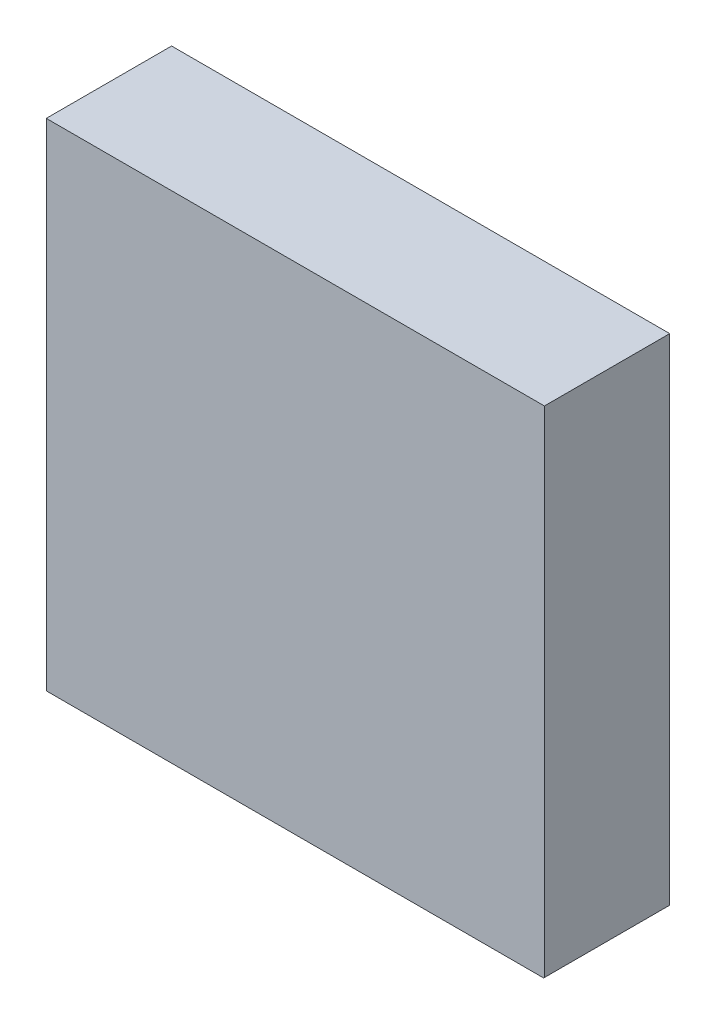
ISO-10303-21;
HEADER;
FILE_DESCRIPTION(('STEP AP214'),'2;1');
FILE_NAME('part.step','',(''),(''),'','','');
FILE_SCHEMA(('AUTOMOTIVE_DESIGN { 1 0 10303 214 1 1 1 1 }'));
ENDSEC;
DATA;
#1=APPLICATION_CONTEXT('core data for automotive mechanical design processes');
#2=APPLICATION_PROTOCOL_DEFINITION('international standard','automotive_design',2000,#1);
#3=PRODUCT_CONTEXT('',#1,'mechanical');
#4=PRODUCT('Part','Part','',(#3));
#5=PRODUCT_RELATED_PRODUCT_CATEGORY('part','',(#4));
#6=PRODUCT_DEFINITION_FORMATION('','',#4);
#7=PRODUCT_DEFINITION_CONTEXT('part definition',#1,'design');
#8=PRODUCT_DEFINITION('design','',#6,#7);
#9=PRODUCT_DEFINITION_SHAPE('','',#8);
#10=(LENGTH_UNIT() NAMED_UNIT(*) SI_UNIT(.MILLI.,.METRE.));
#11=(NAMED_UNIT(*) PLANE_ANGLE_UNIT() SI_UNIT($,.RADIAN.));
#12=(NAMED_UNIT(*) SI_UNIT($,.STERADIAN.) SOLID_ANGLE_UNIT());
#13=UNCERTAINTY_MEASURE_WITH_UNIT(LENGTH_MEASURE(1.E-05),#10,'distance_accuracy_value','');
#14=(GEOMETRIC_REPRESENTATION_CONTEXT(3) GLOBAL_UNCERTAINTY_ASSIGNED_CONTEXT((#13)) GLOBAL_UNIT_ASSIGNED_CONTEXT((#10,
#11,#12)) REPRESENTATION_CONTEXT('',''));
#15=CARTESIAN_POINT('',(0.,0.,0.));
#16=DIRECTION('',(0.,0.,1.));
#17=DIRECTION('',(1.,0.,0.));
#18=AXIS2_PLACEMENT_3D('',#15,#16,#17);
#19=CARTESIAN_POINT('',(1.58999936,1.58250128,0.80000094));
#20=DIRECTION('',(0.,0.,-1.));
#21=DIRECTION('',(0.,-1.,0.));
#22=AXIS2_PLACEMENT_3D('',#19,#20,#21);
#23=PLANE('',#22);
#24=DIRECTION('',(-1.,0.,0.));
#25=VECTOR('',#24,1.);
#26=CARTESIAN_POINT('',(1.58999936,1.58250128,0.80000094));
#27=LINE('',#26,#25);
#28=CARTESIAN_POINT('',(1.58999936,1.58250128,0.80000094));
#29=VERTEX_POINT('',#28);
#30=CARTESIAN_POINT('',(-1.58999682,1.5824962,0.80000094));
#31=VERTEX_POINT('',#30);
#32=EDGE_CURVE('E89',#29,#31,#27,.T.);
#33=ORIENTED_EDGE('',*,*,#32,.T.);
#34=DIRECTION('',(0.,-1.,0.));
#35=VECTOR('',#34,1.);
#36=CARTESIAN_POINT('',(-1.58999682,1.5824962,0.80000094));
#37=LINE('',#36,#35);
#38=CARTESIAN_POINT('',(-1.58999682,-1.58250128,0.80000094));
#39=VERTEX_POINT('',#38);
#40=EDGE_CURVE('E117',#31,#39,#37,.T.);
#41=ORIENTED_EDGE('',*,*,#40,.T.);
#42=DIRECTION('',(1.,0.,0.));
#43=VECTOR('',#42,1.);
#44=CARTESIAN_POINT('',(-1.58999682,-1.58250128,0.80000094));
#45=LINE('',#44,#43);
#46=CARTESIAN_POINT('',(1.5849981,-1.58250128,0.80000094));
#47=VERTEX_POINT('',#46);
#48=EDGE_CURVE('E129',#39,#47,#45,.T.);
#49=ORIENTED_EDGE('',*,*,#48,.T.);
#50=DIRECTION('',(0.707106781194548,0.707106781178548,0.));
#51=VECTOR('',#50,1.);
#52=CARTESIAN_POINT('',(1.5849981,-1.58250128,0.80000094));
#53=LINE('',#52,#51);
#54=CARTESIAN_POINT('',(1.58999936,-1.57750002,0.80000094));
#55=VERTEX_POINT('',#54);
#56=EDGE_CURVE('E81',#47,#55,#53,.T.);
#57=ORIENTED_EDGE('',*,*,#56,.T.);
#58=DIRECTION('',(0.,1.,0.));
#59=VECTOR('',#58,1.);
#60=CARTESIAN_POINT('',(1.58999936,-1.57750002,0.80000094));
#61=LINE('',#60,#59);
#62=EDGE_CURVE('E26',#55,#29,#61,.T.);
#63=ORIENTED_EDGE('',*,*,#62,.T.);
#64=EDGE_LOOP('',(#33,#41,#49,#57,#63));
#65=FACE_BOUND('',#64,.T.);
#66=ADVANCED_FACE('F17',(#65),#23,.F.);
#67=CARTESIAN_POINT('',(1.58999936,1.58250128,0.));
#68=DIRECTION('',(0.,0.,-1.));
#69=DIRECTION('',(0.,-1.,0.));
#70=AXIS2_PLACEMENT_3D('',#67,#68,#69);
#71=PLANE('',#70);
#72=DIRECTION('',(0.,1.,0.));
#73=VECTOR('',#72,1.);
#74=CARTESIAN_POINT('',(1.58999936,-1.57750002,0.));
#75=LINE('',#74,#73);
#76=CARTESIAN_POINT('',(1.58999936,-1.57750002,0.));
#77=VERTEX_POINT('',#76);
#78=CARTESIAN_POINT('',(1.58999936,1.58250128,0.));
#79=VERTEX_POINT('',#78);
#80=EDGE_CURVE('E70',#77,#79,#75,.T.);
#81=ORIENTED_EDGE('',*,*,#80,.F.);
#82=DIRECTION('',(0.707106781194548,0.707106781178548,0.));
#83=VECTOR('',#82,1.);
#84=CARTESIAN_POINT('',(1.5849981,-1.58250128,0.));
#85=LINE('',#84,#83);
#86=CARTESIAN_POINT('',(1.5849981,-1.58250128,0.));
#87=VERTEX_POINT('',#86);
#88=EDGE_CURVE('E127',#87,#77,#85,.T.);
#89=ORIENTED_EDGE('',*,*,#88,.F.);
#90=DIRECTION('',(1.,0.,0.));
#91=VECTOR('',#90,1.);
#92=CARTESIAN_POINT('',(-1.58999682,-1.58250128,0.));
#93=LINE('',#92,#91);
#94=CARTESIAN_POINT('',(-1.58999682,-1.58250128,0.));
#95=VERTEX_POINT('',#94);
#96=EDGE_CURVE('E125',#95,#87,#93,.T.);
#97=ORIENTED_EDGE('',*,*,#96,.F.);
#98=DIRECTION('',(0.,-1.,0.));
#99=VECTOR('',#98,1.);
#100=CARTESIAN_POINT('',(-1.58999682,1.5824962,0.));
#101=LINE('',#100,#99);
#102=CARTESIAN_POINT('',(-1.58999682,1.5824962,0.));
#103=VERTEX_POINT('',#102);
#104=EDGE_CURVE('E91',#103,#95,#101,.T.);
#105=ORIENTED_EDGE('',*,*,#104,.F.);
#106=DIRECTION('',(-1.,0.,0.));
#107=VECTOR('',#106,1.);
#108=CARTESIAN_POINT('',(1.58999936,1.58250128,0.));
#109=LINE('',#108,#107);
#110=EDGE_CURVE('E86',#79,#103,#109,.T.);
#111=ORIENTED_EDGE('',*,*,#110,.F.);
#112=EDGE_LOOP('',(#81,#89,#97,#105,#111));
#113=FACE_BOUND('',#112,.T.);
#114=ADVANCED_FACE('F93',(#113),#71,.T.);
#115=CARTESIAN_POINT('',(1.58999936,-1.57750002,0.));
#116=DIRECTION('',(-1.,0.,0.));
#117=DIRECTION('',(0.,0.,1.));
#118=AXIS2_PLACEMENT_3D('',#115,#116,#117);
#119=PLANE('',#118);
#120=ORIENTED_EDGE('',*,*,#80,.T.);
#121=DIRECTION('',(0.,0.,1.));
#122=VECTOR('',#121,1.);
#123=CARTESIAN_POINT('',(1.58999936,1.58250128,0.));
#124=LINE('',#123,#122);
#125=EDGE_CURVE('E73',#79,#29,#124,.T.);
#126=ORIENTED_EDGE('',*,*,#125,.T.);
#127=ORIENTED_EDGE('',*,*,#62,.F.);
#128=DIRECTION('',(0.,0.,1.));
#129=VECTOR('',#128,1.);
#130=CARTESIAN_POINT('',(1.58999936,-1.57750002,0.));
#131=LINE('',#130,#129);
#132=EDGE_CURVE('E76',#77,#55,#131,.T.);
#133=ORIENTED_EDGE('',*,*,#132,.F.);
#134=EDGE_LOOP('',(#120,#126,#127,#133));
#135=FACE_BOUND('',#134,.T.);
#136=ADVANCED_FACE('F72',(#135),#119,.F.);
#137=CARTESIAN_POINT('',(1.5849981,-1.58250128,0.));
#138=DIRECTION('',(-0.707106781178548,0.707106781194548,0.));
#139=DIRECTION('',(0.,0.,1.));
#140=AXIS2_PLACEMENT_3D('',#137,#138,#139);
#141=PLANE('',#140);
#142=ORIENTED_EDGE('',*,*,#88,.T.);
#143=ORIENTED_EDGE('',*,*,#132,.T.);
#144=ORIENTED_EDGE('',*,*,#56,.F.);
#145=DIRECTION('',(0.,0.,1.));
#146=VECTOR('',#145,1.);
#147=CARTESIAN_POINT('',(1.5849981,-1.58250128,0.));
#148=LINE('',#147,#146);
#149=EDGE_CURVE('E133',#87,#47,#148,.T.);
#150=ORIENTED_EDGE('',*,*,#149,.F.);
#151=EDGE_LOOP('',(#142,#143,#144,#150));
#152=FACE_BOUND('',#151,.T.);
#153=ADVANCED_FACE('F154',(#152),#141,.F.);
#154=CARTESIAN_POINT('',(-1.58999682,-1.58250128,0.));
#155=DIRECTION('',(0.,1.,0.));
#156=DIRECTION('',(1.,0.,0.));
#157=AXIS2_PLACEMENT_3D('',#154,#155,#156);
#158=PLANE('',#157);
#159=ORIENTED_EDGE('',*,*,#96,.T.);
#160=ORIENTED_EDGE('',*,*,#149,.T.);
#161=ORIENTED_EDGE('',*,*,#48,.F.);
#162=DIRECTION('',(0.,0.,1.));
#163=VECTOR('',#162,1.);
#164=CARTESIAN_POINT('',(-1.58999682,-1.58250128,0.));
#165=LINE('',#164,#163);
#166=EDGE_CURVE('E110',#95,#39,#165,.T.);
#167=ORIENTED_EDGE('',*,*,#166,.F.);
#168=EDGE_LOOP('',(#159,#160,#161,#167));
#169=FACE_BOUND('',#168,.T.);
#170=ADVANCED_FACE('F156',(#169),#158,.F.);
#171=CARTESIAN_POINT('',(-1.58999682,1.5824962,0.));
#172=DIRECTION('',(1.,0.,0.));
#173=DIRECTION('',(0.,1.,0.));
#174=AXIS2_PLACEMENT_3D('',#171,#172,#173);
#175=PLANE('',#174);
#176=DIRECTION('',(0.,0.,-1.));
#177=VECTOR('',#176,1.);
#178=CARTESIAN_POINT('',(-1.58999682,1.58250128,0.));
#179=LINE('',#178,#177);
#180=EDGE_CURVE('E11',#103,#31,#179,.F.);
#181=ORIENTED_EDGE('',*,*,#180,.F.);
#182=ORIENTED_EDGE('',*,*,#104,.T.);
#183=ORIENTED_EDGE('',*,*,#166,.T.);
#184=ORIENTED_EDGE('',*,*,#40,.F.);
#185=EDGE_LOOP('',(#181,#182,#183,#184));
#186=FACE_BOUND('',#185,.T.);
#187=ADVANCED_FACE('F157',(#186),#175,.F.);
#188=CARTESIAN_POINT('',(1.58999936,1.58250128,0.));
#189=DIRECTION('',(0.,-1.,0.));
#190=DIRECTION('',(0.,0.,-1.));
#191=AXIS2_PLACEMENT_3D('',#188,#189,#190);
#192=PLANE('',#191);
#193=ORIENTED_EDGE('',*,*,#110,.T.);
#194=ORIENTED_EDGE('',*,*,#180,.T.);
#195=ORIENTED_EDGE('',*,*,#32,.F.);
#196=ORIENTED_EDGE('',*,*,#125,.F.);
#197=EDGE_LOOP('',(#193,#194,#195,#196));
#198=FACE_BOUND('',#197,.T.);
#199=ADVANCED_FACE('F85',(#198),#192,.F.);
#200=CLOSED_SHELL('',(#66,#114,#136,#153,#170,#187,#199));
#201=MANIFOLD_SOLID_BREP('B1',#200);
#202=ADVANCED_BREP_SHAPE_REPRESENTATION('',(#18,#201),#14);
#203=SHAPE_DEFINITION_REPRESENTATION(#9,#202);
ENDSEC;
END-ISO-10303-21;
